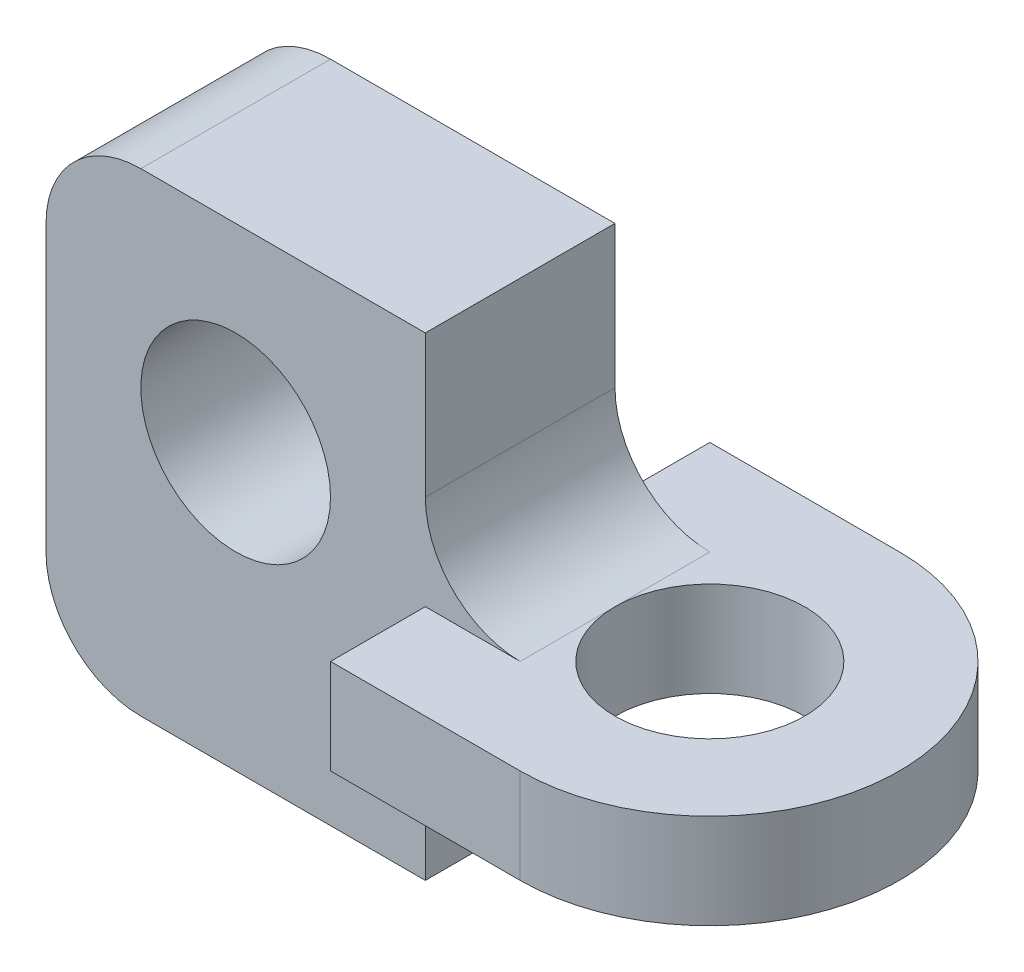
ISO-10303-21;
HEADER;
FILE_DESCRIPTION(('STEP AP214'),'2;1');
FILE_NAME('part.step','',(''),(''),'','','');
FILE_SCHEMA(('AUTOMOTIVE_DESIGN { 1 0 10303 214 1 1 1 1 }'));
ENDSEC;
DATA;
#1=APPLICATION_CONTEXT('core data for automotive mechanical design processes');
#2=APPLICATION_PROTOCOL_DEFINITION('international standard','automotive_design',2000,#1);
#3=PRODUCT_CONTEXT('',#1,'mechanical');
#4=PRODUCT('Part','Part','',(#3));
#5=PRODUCT_RELATED_PRODUCT_CATEGORY('part','',(#4));
#6=PRODUCT_DEFINITION_FORMATION('','',#4);
#7=PRODUCT_DEFINITION_CONTEXT('part definition',#1,'design');
#8=PRODUCT_DEFINITION('design','',#6,#7);
#9=PRODUCT_DEFINITION_SHAPE('','',#8);
#10=(LENGTH_UNIT() NAMED_UNIT(*) SI_UNIT(.MILLI.,.METRE.));
#11=(NAMED_UNIT(*) PLANE_ANGLE_UNIT() SI_UNIT($,.RADIAN.));
#12=(NAMED_UNIT(*) SI_UNIT($,.STERADIAN.) SOLID_ANGLE_UNIT());
#13=UNCERTAINTY_MEASURE_WITH_UNIT(LENGTH_MEASURE(1.E-05),#10,'distance_accuracy_value','');
#14=(GEOMETRIC_REPRESENTATION_CONTEXT(3) GLOBAL_UNCERTAINTY_ASSIGNED_CONTEXT((#13)) GLOBAL_UNIT_ASSIGNED_CONTEXT((#10,
#11,#12)) REPRESENTATION_CONTEXT('',''));
#15=CARTESIAN_POINT('',(0.,0.,0.));
#16=DIRECTION('',(0.,0.,1.));
#17=DIRECTION('',(1.,0.,0.));
#18=AXIS2_PLACEMENT_3D('',#15,#16,#17);
#19=CARTESIAN_POINT('',(-10.,2.5,-10.));
#20=DIRECTION('',(1.,0.,0.));
#21=DIRECTION('',(0.,0.,-1.));
#22=AXIS2_PLACEMENT_3D('',#19,#20,#21);
#23=PLANE('',#22);
#24=DIRECTION('',(0.,1.,0.));
#25=VECTOR('',#24,1.);
#26=CARTESIAN_POINT('',(-10.,-10.,5.));
#27=LINE('',#26,#25);
#28=CARTESIAN_POINT('',(-10.,-2.5,5.));
#29=VERTEX_POINT('',#28);
#30=CARTESIAN_POINT('',(-10.,2.5,5.));
#31=VERTEX_POINT('',#30);
#32=EDGE_CURVE('E187',#29,#31,#27,.T.);
#33=ORIENTED_EDGE('',*,*,#32,.F.);
#34=DIRECTION('',(0.,0.,1.));
#35=VECTOR('',#34,1.);
#36=CARTESIAN_POINT('',(-10.,-2.5,-10.));
#37=LINE('',#36,#35);
#38=CARTESIAN_POINT('',(-10.,-2.5,10.));
#39=VERTEX_POINT('',#38);
#40=EDGE_CURVE('E240',#29,#39,#37,.T.);
#41=ORIENTED_EDGE('',*,*,#40,.T.);
#42=DIRECTION('',(0.,-1.,0.));
#43=VECTOR('',#42,1.);
#44=CARTESIAN_POINT('',(-10.,2.5,10.));
#45=LINE('',#44,#43);
#46=CARTESIAN_POINT('',(-10.,2.5,10.));
#47=VERTEX_POINT('',#46);
#48=EDGE_CURVE('E247',#47,#39,#45,.T.);
#49=ORIENTED_EDGE('',*,*,#48,.F.);
#50=DIRECTION('',(0.,0.,1.));
#51=VECTOR('',#50,1.);
#52=CARTESIAN_POINT('',(-10.,2.5,-10.));
#53=LINE('',#52,#51);
#54=EDGE_CURVE('E230',#31,#47,#53,.T.);
#55=ORIENTED_EDGE('',*,*,#54,.F.);
#56=EDGE_LOOP('',(#33,#41,#49,#55));
#57=FACE_BOUND('',#56,.T.);
#58=ADVANCED_FACE('F33',(#57),#23,.F.);
#59=CARTESIAN_POINT('',(0.,2.5,0.));
#60=DIRECTION('',(0.,1.,0.));
#61=DIRECTION('',(0.,0.,1.));
#62=AXIS2_PLACEMENT_3D('',#59,#60,#61);
#63=PLANE('',#62);
#64=DIRECTION('',(0.,0.,1.));
#65=VECTOR('',#64,1.);
#66=CARTESIAN_POINT('',(-5.,2.5,0.));
#67=LINE('',#66,#65);
#68=CARTESIAN_POINT('',(-5.,2.5,0.));
#69=VERTEX_POINT('',#68);
#70=CARTESIAN_POINT('',(-5.,2.5,5.));
#71=VERTEX_POINT('',#70);
#72=EDGE_CURVE('E271',#69,#71,#67,.T.);
#73=ORIENTED_EDGE('',*,*,#72,.T.);
#74=DIRECTION('',(-1.,0.,0.));
#75=VECTOR('',#74,1.);
#76=CARTESIAN_POINT('',(0.,2.5,5.));
#77=LINE('',#76,#75);
#78=EDGE_CURVE('E274',#71,#31,#77,.T.);
#79=ORIENTED_EDGE('',*,*,#78,.T.);
#80=ORIENTED_EDGE('',*,*,#54,.T.);
#81=DIRECTION('',(1.,0.,0.));
#82=VECTOR('',#81,1.);
#83=CARTESIAN_POINT('',(-10.,2.5,10.));
#84=LINE('',#83,#82);
#85=CARTESIAN_POINT('',(0.,2.5,10.));
#86=VERTEX_POINT('',#85);
#87=EDGE_CURVE('E233',#47,#86,#84,.T.);
#88=ORIENTED_EDGE('',*,*,#87,.T.);
#89=CARTESIAN_POINT('',(0.,2.5,0.));
#90=DIRECTION('',(0.,1.,0.));
#91=DIRECTION('',(0.,0.,1.));
#92=AXIS2_PLACEMENT_3D('',#89,#90,#91);
#93=CIRCLE('',#92,10.);
#94=CARTESIAN_POINT('',(0.,2.5,-10.));
#95=VERTEX_POINT('',#94);
#96=EDGE_CURVE('E224',#86,#95,#93,.T.);
#97=ORIENTED_EDGE('',*,*,#96,.T.);
#98=DIRECTION('',(-1.,0.,0.));
#99=VECTOR('',#98,1.);
#100=CARTESIAN_POINT('',(0.,2.5,-10.));
#101=LINE('',#100,#99);
#102=CARTESIAN_POINT('',(-10.,2.5,-10.));
#103=VERTEX_POINT('',#102);
#104=EDGE_CURVE('E227',#95,#103,#101,.T.);
#105=ORIENTED_EDGE('',*,*,#104,.T.);
#106=CARTESIAN_POINT('',(-10.,2.5,-5.));
#107=VERTEX_POINT('',#106);
#108=EDGE_CURVE('E231',#103,#107,#53,.T.);
#109=ORIENTED_EDGE('',*,*,#108,.T.);
#110=DIRECTION('',(1.,0.,0.));
#111=VECTOR('',#110,1.);
#112=CARTESIAN_POINT('',(-25.,2.5,-5.));
#113=LINE('',#112,#111);
#114=CARTESIAN_POINT('',(-5.,2.5,-5.));
#115=VERTEX_POINT('',#114);
#116=EDGE_CURVE('E47',#107,#115,#113,.T.);
#117=ORIENTED_EDGE('',*,*,#116,.T.);
#118=DIRECTION('',(0.,0.,1.));
#119=VECTOR('',#118,1.);
#120=CARTESIAN_POINT('',(-5.,2.5,0.));
#121=LINE('',#120,#119);
#122=EDGE_CURVE('E268',#115,#69,#121,.T.);
#123=ORIENTED_EDGE('',*,*,#122,.T.);
#124=CARTESIAN_POINT('',(0.,2.5,0.));
#125=DIRECTION('',(0.,1.,0.));
#126=DIRECTION('',(0.,0.,1.));
#127=AXIS2_PLACEMENT_3D('',#124,#125,#126);
#128=CIRCLE('',#127,5.);
#129=EDGE_CURVE('E218',#69,#69,#128,.T.);
#130=ORIENTED_EDGE('',*,*,#129,.F.);
#131=EDGE_LOOP('',(#73,#79,#80,#88,#97,#105,#109,#117,#123,#130));
#132=FACE_BOUND('',#131,.T.);
#133=ADVANCED_FACE('F296',(#132),#63,.T.);
#134=CARTESIAN_POINT('',(0.,-2.5,0.));
#135=DIRECTION('',(0.,1.,0.));
#136=DIRECTION('',(0.,0.,1.));
#137=AXIS2_PLACEMENT_3D('',#134,#135,#136);
#138=PLANE('',#137);
#139=ORIENTED_EDGE('',*,*,#40,.F.);
#140=DIRECTION('',(1.,0.,0.));
#141=VECTOR('',#140,1.);
#142=CARTESIAN_POINT('',(-25.,-2.5,5.));
#143=LINE('',#142,#141);
#144=CARTESIAN_POINT('',(-4.99999999999999,-2.5,5.));
#145=VERTEX_POINT('',#144);
#146=EDGE_CURVE('E55',#29,#145,#143,.T.);
#147=ORIENTED_EDGE('',*,*,#146,.T.);
#148=DIRECTION('',(0.,0.,1.));
#149=VECTOR('',#148,1.);
#150=CARTESIAN_POINT('',(-4.99999999999999,-2.5,-5.));
#151=LINE('',#150,#149);
#152=CARTESIAN_POINT('',(-4.99999999999999,-2.5,0.));
#153=VERTEX_POINT('',#152);
#154=EDGE_CURVE('E264',#145,#153,#151,.F.);
#155=ORIENTED_EDGE('',*,*,#154,.T.);
#156=CARTESIAN_POINT('',(0.,-2.5,0.));
#157=DIRECTION('',(0.,1.,0.));
#158=DIRECTION('',(0.,0.,1.));
#159=AXIS2_PLACEMENT_3D('',#156,#157,#158);
#160=CIRCLE('',#159,5.);
#161=EDGE_CURVE('E171',#153,#153,#160,.T.);
#162=ORIENTED_EDGE('',*,*,#161,.T.);
#163=DIRECTION('',(0.,0.,1.));
#164=VECTOR('',#163,1.);
#165=CARTESIAN_POINT('',(-4.99999999999999,-2.5,-5.));
#166=LINE('',#165,#164);
#167=CARTESIAN_POINT('',(-4.99999999999999,-2.5,-5.));
#168=VERTEX_POINT('',#167);
#169=EDGE_CURVE('E261',#153,#168,#166,.F.);
#170=ORIENTED_EDGE('',*,*,#169,.T.);
#171=DIRECTION('',(-1.,0.,0.));
#172=VECTOR('',#171,1.);
#173=CARTESIAN_POINT('',(0.,-2.5,-5.));
#174=LINE('',#173,#172);
#175=CARTESIAN_POINT('',(-10.,-2.5,-5.));
#176=VERTEX_POINT('',#175);
#177=EDGE_CURVE('E259',#168,#176,#174,.T.);
#178=ORIENTED_EDGE('',*,*,#177,.T.);
#179=CARTESIAN_POINT('',(-10.,-2.5,-10.));
#180=VERTEX_POINT('',#179);
#181=EDGE_CURVE('E241',#180,#176,#37,.T.);
#182=ORIENTED_EDGE('',*,*,#181,.F.);
#183=DIRECTION('',(-1.,0.,0.));
#184=VECTOR('',#183,1.);
#185=CARTESIAN_POINT('',(0.,-2.5,-10.));
#186=LINE('',#185,#184);
#187=CARTESIAN_POINT('',(0.,-2.5,-10.));
#188=VERTEX_POINT('',#187);
#189=EDGE_CURVE('E238',#188,#180,#186,.T.);
#190=ORIENTED_EDGE('',*,*,#189,.F.);
#191=CARTESIAN_POINT('',(0.,-2.5,0.));
#192=DIRECTION('',(0.,1.,0.));
#193=DIRECTION('',(0.,0.,1.));
#194=AXIS2_PLACEMENT_3D('',#191,#192,#193);
#195=CIRCLE('',#194,10.);
#196=CARTESIAN_POINT('',(0.,-2.5,10.));
#197=VERTEX_POINT('',#196);
#198=EDGE_CURVE('E221',#197,#188,#195,.T.);
#199=ORIENTED_EDGE('',*,*,#198,.F.);
#200=DIRECTION('',(1.,0.,0.));
#201=VECTOR('',#200,1.);
#202=CARTESIAN_POINT('',(-10.,-2.5,10.));
#203=LINE('',#202,#201);
#204=EDGE_CURVE('E228',#39,#197,#203,.T.);
#205=ORIENTED_EDGE('',*,*,#204,.F.);
#206=EDGE_LOOP('',(#139,#147,#155,#162,#170,#178,#182,#190,#199,#205));
#207=FACE_BOUND('',#206,.T.);
#208=ADVANCED_FACE('F328',(#207),#138,.F.);
#209=CARTESIAN_POINT('',(0.,2.5,0.));
#210=DIRECTION('',(0.,-1.,0.));
#211=DIRECTION('',(0.,0.,-1.));
#212=AXIS2_PLACEMENT_3D('',#209,#210,#211);
#213=CYLINDRICAL_SURFACE('',#212,10.);
#214=ORIENTED_EDGE('',*,*,#198,.T.);
#215=DIRECTION('',(0.,-1.,0.));
#216=VECTOR('',#215,1.);
#217=CARTESIAN_POINT('',(0.,2.5,-10.));
#218=LINE('',#217,#216);
#219=EDGE_CURVE('E253',#95,#188,#218,.T.);
#220=ORIENTED_EDGE('',*,*,#219,.F.);
#221=ORIENTED_EDGE('',*,*,#96,.F.);
#222=DIRECTION('',(0.,-1.,0.));
#223=VECTOR('',#222,1.);
#224=CARTESIAN_POINT('',(0.,2.5,10.));
#225=LINE('',#224,#223);
#226=EDGE_CURVE('E235',#86,#197,#225,.T.);
#227=ORIENTED_EDGE('',*,*,#226,.T.);
#228=EDGE_LOOP('',(#214,#220,#221,#227));
#229=FACE_BOUND('',#228,.T.);
#230=ADVANCED_FACE('F342',(#229),#213,.T.);
#231=CARTESIAN_POINT('',(0.,2.5,-10.));
#232=DIRECTION('',(0.,0.,1.));
#233=DIRECTION('',(1.,0.,0.));
#234=AXIS2_PLACEMENT_3D('',#231,#232,#233);
#235=PLANE('',#234);
#236=ORIENTED_EDGE('',*,*,#189,.T.);
#237=DIRECTION('',(0.,-1.,0.));
#238=VECTOR('',#237,1.);
#239=CARTESIAN_POINT('',(-10.,2.5,-10.));
#240=LINE('',#239,#238);
#241=EDGE_CURVE('E250',#103,#180,#240,.T.);
#242=ORIENTED_EDGE('',*,*,#241,.F.);
#243=ORIENTED_EDGE('',*,*,#104,.F.);
#244=ORIENTED_EDGE('',*,*,#219,.T.);
#245=EDGE_LOOP('',(#236,#242,#243,#244));
#246=FACE_BOUND('',#245,.T.);
#247=ADVANCED_FACE('F335',(#246),#235,.F.);
#248=ORIENTED_EDGE('',*,*,#181,.T.);
#249=DIRECTION('',(0.,1.,0.));
#250=VECTOR('',#249,1.);
#251=CARTESIAN_POINT('',(-10.,15.,-5.));
#252=LINE('',#251,#250);
#253=EDGE_CURVE('E203',#176,#107,#252,.T.);
#254=ORIENTED_EDGE('',*,*,#253,.T.);
#255=ORIENTED_EDGE('',*,*,#108,.F.);
#256=ORIENTED_EDGE('',*,*,#241,.T.);
#257=EDGE_LOOP('',(#248,#254,#255,#256));
#258=FACE_BOUND('',#257,.T.);
#259=ADVANCED_FACE('F302',(#258),#23,.F.);
#260=CARTESIAN_POINT('',(-10.,2.5,10.));
#261=DIRECTION('',(0.,0.,-1.));
#262=DIRECTION('',(-1.,0.,0.));
#263=AXIS2_PLACEMENT_3D('',#260,#261,#262);
#264=PLANE('',#263);
#265=ORIENTED_EDGE('',*,*,#204,.T.);
#266=ORIENTED_EDGE('',*,*,#226,.F.);
#267=ORIENTED_EDGE('',*,*,#87,.F.);
#268=ORIENTED_EDGE('',*,*,#48,.T.);
#269=EDGE_LOOP('',(#265,#266,#267,#268));
#270=FACE_BOUND('',#269,.T.);
#271=ADVANCED_FACE('F334',(#270),#264,.F.);
#272=CARTESIAN_POINT('',(0.,2.5,0.));
#273=DIRECTION('',(0.,-1.,0.));
#274=DIRECTION('',(0.,0.,-1.));
#275=AXIS2_PLACEMENT_3D('',#272,#273,#274);
#276=CYLINDRICAL_SURFACE('',#275,5.);
#277=ORIENTED_EDGE('',*,*,#129,.T.);
#278=EDGE_LOOP('',(#277));
#279=FACE_BOUND('',#278,.T.);
#280=ORIENTED_EDGE('',*,*,#161,.F.);
#281=EDGE_LOOP('',(#280));
#282=FACE_BOUND('',#281,.T.);
#283=ADVANCED_FACE('F340',(#279,#282),#276,.F.);
#284=CARTESIAN_POINT('',(-10.,15.,5.));
#285=DIRECTION('',(-1.,0.,0.));
#286=DIRECTION('',(0.,-1.,0.));
#287=AXIS2_PLACEMENT_3D('',#284,#285,#286);
#288=PLANE('',#287);
#289=CARTESIAN_POINT('',(-10.,-10.,-5.));
#290=VERTEX_POINT('',#289);
#291=CARTESIAN_POINT('',(-9.99999999999999,-7.5,-5.));
#292=VERTEX_POINT('',#291);
#293=EDGE_CURVE('E199',#290,#292,#252,.T.);
#294=ORIENTED_EDGE('',*,*,#293,.T.);
#295=DIRECTION('',(0.,0.,1.));
#296=VECTOR('',#295,1.);
#297=CARTESIAN_POINT('',(-9.99999999999999,-7.5,5.));
#298=LINE('',#297,#296);
#299=CARTESIAN_POINT('',(-10.,-7.5,5.));
#300=VERTEX_POINT('',#299);
#301=EDGE_CURVE('E256',#292,#300,#298,.T.);
#302=ORIENTED_EDGE('',*,*,#301,.T.);
#303=CARTESIAN_POINT('',(-10.,-10.,5.));
#304=VERTEX_POINT('',#303);
#305=EDGE_CURVE('E183',#304,#300,#27,.T.);
#306=ORIENTED_EDGE('',*,*,#305,.F.);
#307=DIRECTION('',(0.,0.,-1.));
#308=VECTOR('',#307,1.);
#309=CARTESIAN_POINT('',(-10.,-10.,5.));
#310=LINE('',#309,#308);
#311=EDGE_CURVE('E214',#304,#290,#310,.T.);
#312=ORIENTED_EDGE('',*,*,#311,.T.);
#313=EDGE_LOOP('',(#294,#302,#306,#312));
#314=FACE_BOUND('',#313,.T.);
#315=ADVANCED_FACE('F362',(#314),#288,.F.);
#316=CARTESIAN_POINT('',(-25.,10.,5.));
#317=DIRECTION('',(0.,0.,-1.));
#318=DIRECTION('',(-1.,0.,0.));
#319=AXIS2_PLACEMENT_3D('',#316,#317,#318);
#320=PLANE('',#319);
#321=DIRECTION('',(0.,-1.,0.));
#322=VECTOR('',#321,1.);
#323=CARTESIAN_POINT('',(-30.,1.89825706062081,5.));
#324=LINE('',#323,#322);
#325=CARTESIAN_POINT('',(-30.,9.99999999999996,5.));
#326=VERTEX_POINT('',#325);
#327=CARTESIAN_POINT('',(-30.,-4.99999999999997,5.));
#328=VERTEX_POINT('',#327);
#329=EDGE_CURVE('E151',#326,#328,#324,.T.);
#330=ORIENTED_EDGE('',*,*,#329,.T.);
#331=CARTESIAN_POINT('',(-25.,-5.,5.));
#332=DIRECTION('',(0.,0.,1.));
#333=DIRECTION('',(1.,0.,0.));
#334=AXIS2_PLACEMENT_3D('',#331,#332,#333);
#335=CIRCLE('',#334,5.);
#336=CARTESIAN_POINT('',(-25.,-10.,5.));
#337=VERTEX_POINT('',#336);
#338=EDGE_CURVE('E156',#328,#337,#335,.T.);
#339=ORIENTED_EDGE('',*,*,#338,.T.);
#340=DIRECTION('',(1.,0.,0.));
#341=VECTOR('',#340,1.);
#342=CARTESIAN_POINT('',(-25.,-10.,5.));
#343=LINE('',#342,#341);
#344=EDGE_CURVE('E177',#337,#304,#343,.T.);
#345=ORIENTED_EDGE('',*,*,#344,.T.);
#346=ORIENTED_EDGE('',*,*,#305,.T.);
#347=CARTESIAN_POINT('',(-4.99999999999999,-7.5,5.));
#348=DIRECTION('',(0.,0.,-1.));
#349=DIRECTION('',(-1.,0.,0.));
#350=AXIS2_PLACEMENT_3D('',#347,#348,#349);
#351=CIRCLE('',#350,5.);
#352=EDGE_CURVE('E278',#300,#145,#351,.T.);
#353=ORIENTED_EDGE('',*,*,#352,.T.);
#354=ORIENTED_EDGE('',*,*,#146,.F.);
#355=ORIENTED_EDGE('',*,*,#32,.T.);
#356=ORIENTED_EDGE('',*,*,#78,.F.);
#357=CARTESIAN_POINT('',(-5.,7.5,5.));
#358=DIRECTION('',(0.,0.,-1.));
#359=DIRECTION('',(-1.,0.,0.));
#360=AXIS2_PLACEMENT_3D('',#357,#358,#359);
#361=CIRCLE('',#360,5.);
#362=CARTESIAN_POINT('',(-10.,7.5,5.));
#363=VERTEX_POINT('',#362);
#364=EDGE_CURVE('E41',#71,#363,#361,.T.);
#365=ORIENTED_EDGE('',*,*,#364,.T.);
#366=CARTESIAN_POINT('',(-10.,15.,5.));
#367=VERTEX_POINT('',#366);
#368=EDGE_CURVE('E179',#363,#367,#27,.T.);
#369=ORIENTED_EDGE('',*,*,#368,.T.);
#370=DIRECTION('',(-1.,0.,0.));
#371=VECTOR('',#370,1.);
#372=CARTESIAN_POINT('',(-25.,15.,5.));
#373=LINE('',#372,#371);
#374=CARTESIAN_POINT('',(-25.,15.,5.));
#375=VERTEX_POINT('',#374);
#376=EDGE_CURVE('E186',#367,#375,#373,.T.);
#377=ORIENTED_EDGE('',*,*,#376,.T.);
#378=CARTESIAN_POINT('',(-25.,10.,5.));
#379=DIRECTION('',(0.,0.,1.));
#380=DIRECTION('',(-1.,0.,0.));
#381=AXIS2_PLACEMENT_3D('',#378,#379,#380);
#382=CIRCLE('',#381,5.);
#383=EDGE_CURVE('E159',#375,#326,#382,.T.);
#384=ORIENTED_EDGE('',*,*,#383,.T.);
#385=EDGE_LOOP('',(#330,#339,#345,#346,#353,#354,#355,#356,#365,#369,#377,#384));
#386=FACE_BOUND('',#385,.T.);
#387=CARTESIAN_POINT('',(-20.,5.,5.));
#388=DIRECTION('',(0.,0.,1.));
#389=DIRECTION('',(1.,0.,0.));
#390=AXIS2_PLACEMENT_3D('',#387,#388,#389);
#391=CIRCLE('',#390,5.);
#392=CARTESIAN_POINT('',(-15.,5.,5.));
#393=VERTEX_POINT('',#392);
#394=EDGE_CURVE('E193',#393,#393,#391,.T.);
#395=ORIENTED_EDGE('',*,*,#394,.F.);
#396=EDGE_LOOP('',(#395));
#397=FACE_BOUND('',#396,.T.);
#398=ADVANCED_FACE('F153',(#386,#397),#320,.F.);
#399=CARTESIAN_POINT('',(-25.,10.,-5.));
#400=DIRECTION('',(0.,0.,-1.));
#401=DIRECTION('',(-1.,0.,0.));
#402=AXIS2_PLACEMENT_3D('',#399,#400,#401);
#403=PLANE('',#402);
#404=DIRECTION('',(0.,-1.,0.));
#405=VECTOR('',#404,1.);
#406=CARTESIAN_POINT('',(-30.,1.89825706062081,-5.));
#407=LINE('',#406,#405);
#408=CARTESIAN_POINT('',(-30.,9.99999999999996,-5.));
#409=VERTEX_POINT('',#408);
#410=CARTESIAN_POINT('',(-30.,-4.99999999999997,-5.));
#411=VERTEX_POINT('',#410);
#412=EDGE_CURVE('E168',#409,#411,#407,.T.);
#413=ORIENTED_EDGE('',*,*,#412,.F.);
#414=CARTESIAN_POINT('',(-25.,10.,-5.));
#415=DIRECTION('',(0.,0.,1.));
#416=DIRECTION('',(-1.,0.,0.));
#417=AXIS2_PLACEMENT_3D('',#414,#415,#416);
#418=CIRCLE('',#417,5.);
#419=CARTESIAN_POINT('',(-25.,15.,-5.));
#420=VERTEX_POINT('',#419);
#421=EDGE_CURVE('E163',#420,#409,#418,.T.);
#422=ORIENTED_EDGE('',*,*,#421,.F.);
#423=DIRECTION('',(-1.,0.,0.));
#424=VECTOR('',#423,1.);
#425=CARTESIAN_POINT('',(-25.,15.,-5.));
#426=LINE('',#425,#424);
#427=CARTESIAN_POINT('',(-10.,15.,-5.));
#428=VERTEX_POINT('',#427);
#429=EDGE_CURVE('E202',#428,#420,#426,.T.);
#430=ORIENTED_EDGE('',*,*,#429,.F.);
#431=CARTESIAN_POINT('',(-10.,7.5,-5.));
#432=VERTEX_POINT('',#431);
#433=EDGE_CURVE('E198',#432,#428,#252,.T.);
#434=ORIENTED_EDGE('',*,*,#433,.F.);
#435=CARTESIAN_POINT('',(-5.,7.5,-5.));
#436=DIRECTION('',(0.,0.,-1.));
#437=DIRECTION('',(-1.,0.,0.));
#438=AXIS2_PLACEMENT_3D('',#435,#436,#437);
#439=CIRCLE('',#438,5.);
#440=EDGE_CURVE('E11',#432,#115,#439,.F.);
#441=ORIENTED_EDGE('',*,*,#440,.T.);
#442=ORIENTED_EDGE('',*,*,#116,.F.);
#443=ORIENTED_EDGE('',*,*,#253,.F.);
#444=ORIENTED_EDGE('',*,*,#177,.F.);
#445=CARTESIAN_POINT('',(-4.99999999999999,-7.5,-5.));
#446=DIRECTION('',(0.,0.,-1.));
#447=DIRECTION('',(-1.,0.,0.));
#448=AXIS2_PLACEMENT_3D('',#445,#446,#447);
#449=CIRCLE('',#448,5.);
#450=EDGE_CURVE('E280',#168,#292,#449,.F.);
#451=ORIENTED_EDGE('',*,*,#450,.T.);
#452=ORIENTED_EDGE('',*,*,#293,.F.);
#453=DIRECTION('',(1.,0.,0.));
#454=VECTOR('',#453,1.);
#455=CARTESIAN_POINT('',(-25.,-10.,-5.));
#456=LINE('',#455,#454);
#457=CARTESIAN_POINT('',(-25.,-10.,-5.));
#458=VERTEX_POINT('',#457);
#459=EDGE_CURVE('E195',#458,#290,#456,.T.);
#460=ORIENTED_EDGE('',*,*,#459,.F.);
#461=CARTESIAN_POINT('',(-25.,-5.,-5.));
#462=DIRECTION('',(0.,0.,1.));
#463=DIRECTION('',(1.,0.,0.));
#464=AXIS2_PLACEMENT_3D('',#461,#462,#463);
#465=CIRCLE('',#464,5.);
#466=EDGE_CURVE('E192',#411,#458,#465,.T.);
#467=ORIENTED_EDGE('',*,*,#466,.F.);
#468=EDGE_LOOP('',(#413,#422,#430,#434,#441,#442,#443,#444,#451,#452,#460,#467));
#469=FACE_BOUND('',#468,.T.);
#470=CARTESIAN_POINT('',(-20.,5.,-5.));
#471=DIRECTION('',(0.,0.,1.));
#472=DIRECTION('',(1.,0.,0.));
#473=AXIS2_PLACEMENT_3D('',#470,#471,#472);
#474=CIRCLE('',#473,5.);
#475=CARTESIAN_POINT('',(-15.,5.,-5.));
#476=VERTEX_POINT('',#475);
#477=EDGE_CURVE('E523',#476,#476,#474,.T.);
#478=ORIENTED_EDGE('',*,*,#477,.T.);
#479=EDGE_LOOP('',(#478));
#480=FACE_BOUND('',#479,.T.);
#481=ADVANCED_FACE('F292',(#469,#480),#403,.T.);
#482=CARTESIAN_POINT('',(-30.,1.89825706062081,5.));
#483=DIRECTION('',(1.,0.,0.));
#484=DIRECTION('',(0.,1.,0.));
#485=AXIS2_PLACEMENT_3D('',#482,#483,#484);
#486=PLANE('',#485);
#487=ORIENTED_EDGE('',*,*,#412,.T.);
#488=DIRECTION('',(0.,0.,-1.));
#489=VECTOR('',#488,1.);
#490=CARTESIAN_POINT('',(-30.,-4.99999999999997,5.));
#491=LINE('',#490,#489);
#492=EDGE_CURVE('E166',#328,#411,#491,.T.);
#493=ORIENTED_EDGE('',*,*,#492,.F.);
#494=ORIENTED_EDGE('',*,*,#329,.F.);
#495=DIRECTION('',(0.,0.,-1.));
#496=VECTOR('',#495,1.);
#497=CARTESIAN_POINT('',(-30.,9.99999999999996,5.));
#498=LINE('',#497,#496);
#499=EDGE_CURVE('E190',#326,#409,#498,.T.);
#500=ORIENTED_EDGE('',*,*,#499,.T.);
#501=EDGE_LOOP('',(#487,#493,#494,#500));
#502=FACE_BOUND('',#501,.T.);
#503=ADVANCED_FACE('F167',(#502),#486,.F.);
#504=CARTESIAN_POINT('',(-25.,-5.,5.));
#505=DIRECTION('',(0.,0.,-1.));
#506=DIRECTION('',(-1.,0.,0.));
#507=AXIS2_PLACEMENT_3D('',#504,#505,#506);
#508=CYLINDRICAL_SURFACE('',#507,5.);
#509=ORIENTED_EDGE('',*,*,#466,.T.);
#510=DIRECTION('',(0.,0.,-1.));
#511=VECTOR('',#510,1.);
#512=CARTESIAN_POINT('',(-25.,-10.,5.));
#513=LINE('',#512,#511);
#514=EDGE_CURVE('E172',#337,#458,#513,.T.);
#515=ORIENTED_EDGE('',*,*,#514,.F.);
#516=ORIENTED_EDGE('',*,*,#338,.F.);
#517=ORIENTED_EDGE('',*,*,#492,.T.);
#518=EDGE_LOOP('',(#509,#515,#516,#517));
#519=FACE_BOUND('',#518,.T.);
#520=ADVANCED_FACE('F174',(#519),#508,.T.);
#521=CARTESIAN_POINT('',(-25.,-10.,5.));
#522=DIRECTION('',(0.,1.,0.));
#523=DIRECTION('',(0.,0.,1.));
#524=AXIS2_PLACEMENT_3D('',#521,#522,#523);
#525=PLANE('',#524);
#526=ORIENTED_EDGE('',*,*,#459,.T.);
#527=ORIENTED_EDGE('',*,*,#311,.F.);
#528=ORIENTED_EDGE('',*,*,#344,.F.);
#529=ORIENTED_EDGE('',*,*,#514,.T.);
#530=EDGE_LOOP('',(#526,#527,#528,#529));
#531=FACE_BOUND('',#530,.T.);
#532=ADVANCED_FACE('F420',(#531),#525,.F.);
#533=ORIENTED_EDGE('',*,*,#368,.F.);
#534=DIRECTION('',(0.,0.,1.));
#535=VECTOR('',#534,1.);
#536=CARTESIAN_POINT('',(-10.,7.5,5.));
#537=LINE('',#536,#535);
#538=EDGE_CURVE('E276',#363,#432,#537,.F.);
#539=ORIENTED_EDGE('',*,*,#538,.T.);
#540=ORIENTED_EDGE('',*,*,#433,.T.);
#541=DIRECTION('',(0.,0.,-1.));
#542=VECTOR('',#541,1.);
#543=CARTESIAN_POINT('',(-10.,15.,5.));
#544=LINE('',#543,#542);
#545=EDGE_CURVE('E211',#367,#428,#544,.T.);
#546=ORIENTED_EDGE('',*,*,#545,.F.);
#547=EDGE_LOOP('',(#533,#539,#540,#546));
#548=FACE_BOUND('',#547,.T.);
#549=ADVANCED_FACE('F287',(#548),#288,.F.);
#550=CARTESIAN_POINT('',(-25.,15.,5.));
#551=DIRECTION('',(0.,-1.,0.));
#552=DIRECTION('',(0.,0.,-1.));
#553=AXIS2_PLACEMENT_3D('',#550,#551,#552);
#554=PLANE('',#553);
#555=ORIENTED_EDGE('',*,*,#429,.T.);
#556=DIRECTION('',(0.,0.,-1.));
#557=VECTOR('',#556,1.);
#558=CARTESIAN_POINT('',(-25.,15.,5.));
#559=LINE('',#558,#557);
#560=EDGE_CURVE('E208',#375,#420,#559,.T.);
#561=ORIENTED_EDGE('',*,*,#560,.F.);
#562=ORIENTED_EDGE('',*,*,#376,.F.);
#563=ORIENTED_EDGE('',*,*,#545,.T.);
#564=EDGE_LOOP('',(#555,#561,#562,#563));
#565=FACE_BOUND('',#564,.T.);
#566=ADVANCED_FACE('F305',(#565),#554,.F.);
#567=CARTESIAN_POINT('',(-25.,10.,5.));
#568=DIRECTION('',(0.,0.,-1.));
#569=DIRECTION('',(-1.,0.,0.));
#570=AXIS2_PLACEMENT_3D('',#567,#568,#569);
#571=CYLINDRICAL_SURFACE('',#570,5.);
#572=ORIENTED_EDGE('',*,*,#421,.T.);
#573=ORIENTED_EDGE('',*,*,#499,.F.);
#574=ORIENTED_EDGE('',*,*,#383,.F.);
#575=ORIENTED_EDGE('',*,*,#560,.T.);
#576=EDGE_LOOP('',(#572,#573,#574,#575));
#577=FACE_BOUND('',#576,.T.);
#578=ADVANCED_FACE('F309',(#577),#571,.T.);
#579=CARTESIAN_POINT('',(-20.,5.,5.));
#580=DIRECTION('',(0.,0.,-1.));
#581=DIRECTION('',(-1.,0.,0.));
#582=AXIS2_PLACEMENT_3D('',#579,#580,#581);
#583=CYLINDRICAL_SURFACE('',#582,5.);
#584=ORIENTED_EDGE('',*,*,#394,.T.);
#585=EDGE_LOOP('',(#584));
#586=FACE_BOUND('',#585,.T.);
#587=ORIENTED_EDGE('',*,*,#477,.F.);
#588=EDGE_LOOP('',(#587));
#589=FACE_BOUND('',#588,.T.);
#590=ADVANCED_FACE('F311',(#586,#589),#583,.F.);
#591=CARTESIAN_POINT('',(-4.99999999999999,-7.5,5.));
#592=DIRECTION('',(0.,0.,-1.));
#593=DIRECTION('',(-1.,0.,0.));
#594=AXIS2_PLACEMENT_3D('',#591,#592,#593);
#595=CYLINDRICAL_SURFACE('',#594,5.);
#596=ORIENTED_EDGE('',*,*,#169,.F.);
#597=ORIENTED_EDGE('',*,*,#154,.F.);
#598=ORIENTED_EDGE('',*,*,#352,.F.);
#599=ORIENTED_EDGE('',*,*,#301,.F.);
#600=ORIENTED_EDGE('',*,*,#450,.F.);
#601=EDGE_LOOP('',(#596,#597,#598,#599,#600));
#602=FACE_BOUND('',#601,.T.);
#603=ADVANCED_FACE('F317',(#602),#595,.F.);
#604=CARTESIAN_POINT('',(-5.,7.5,0.));
#605=DIRECTION('',(0.,0.,1.));
#606=DIRECTION('',(1.,0.,0.));
#607=AXIS2_PLACEMENT_3D('',#604,#605,#606);
#608=CYLINDRICAL_SURFACE('',#607,5.);
#609=ORIENTED_EDGE('',*,*,#440,.F.);
#610=ORIENTED_EDGE('',*,*,#538,.F.);
#611=ORIENTED_EDGE('',*,*,#364,.F.);
#612=ORIENTED_EDGE('',*,*,#72,.F.);
#613=ORIENTED_EDGE('',*,*,#122,.F.);
#614=EDGE_LOOP('',(#609,#610,#611,#612,#613));
#615=FACE_BOUND('',#614,.T.);
#616=ADVANCED_FACE('F35',(#615),#608,.F.);
#617=CLOSED_SHELL('',(#58,#133,#208,#230,#247,#259,#271,#283,#315,#398,#481,#503,#520,#532,#549,
#566,#578,#590,#603,#616));
#618=MANIFOLD_SOLID_BREP('B2',#617);
#619=ADVANCED_BREP_SHAPE_REPRESENTATION('',(#18,#618),#14);
#620=SHAPE_DEFINITION_REPRESENTATION(#9,#619);
ENDSEC;
END-ISO-10303-21;
